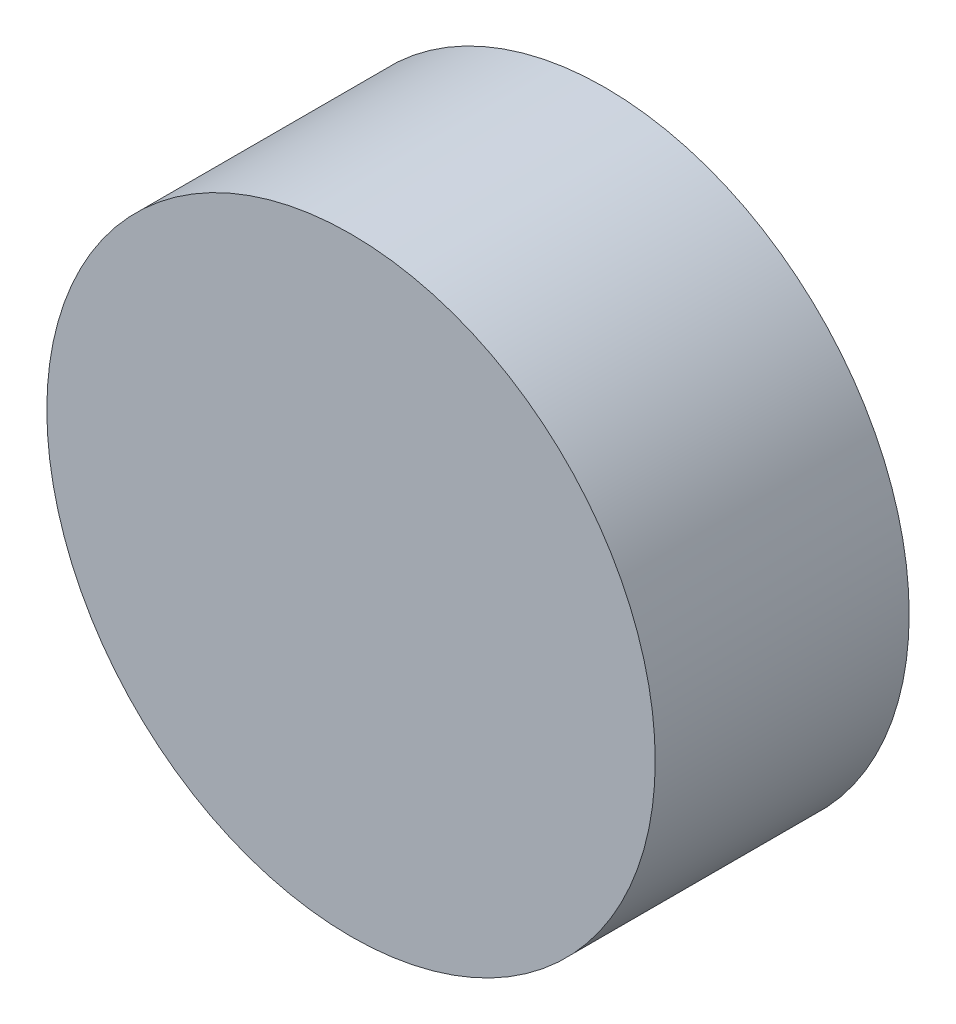
ISO-10303-21;
HEADER;
FILE_DESCRIPTION(('STEP AP214'),'2;1');
FILE_NAME('part.step','',(''),(''),'','','');
FILE_SCHEMA(('AUTOMOTIVE_DESIGN { 1 0 10303 214 1 1 1 1 }'));
ENDSEC;
DATA;
#1=APPLICATION_CONTEXT('core data for automotive mechanical design processes');
#2=APPLICATION_PROTOCOL_DEFINITION('international standard','automotive_design',2000,#1);
#3=PRODUCT_CONTEXT('',#1,'mechanical');
#4=PRODUCT('Part','Part','',(#3));
#5=PRODUCT_RELATED_PRODUCT_CATEGORY('part','',(#4));
#6=PRODUCT_DEFINITION_FORMATION('','',#4);
#7=PRODUCT_DEFINITION_CONTEXT('part definition',#1,'design');
#8=PRODUCT_DEFINITION('design','',#6,#7);
#9=PRODUCT_DEFINITION_SHAPE('','',#8);
#10=(LENGTH_UNIT() NAMED_UNIT(*) SI_UNIT(.MILLI.,.METRE.));
#11=(NAMED_UNIT(*) PLANE_ANGLE_UNIT() SI_UNIT($,.RADIAN.));
#12=(NAMED_UNIT(*) SI_UNIT($,.STERADIAN.) SOLID_ANGLE_UNIT());
#13=UNCERTAINTY_MEASURE_WITH_UNIT(LENGTH_MEASURE(1.E-05),#10,'distance_accuracy_value','');
#14=(GEOMETRIC_REPRESENTATION_CONTEXT(3) GLOBAL_UNCERTAINTY_ASSIGNED_CONTEXT((#13)) GLOBAL_UNIT_ASSIGNED_CONTEXT((#10,
#11,#12)) REPRESENTATION_CONTEXT('',''));
#15=CARTESIAN_POINT('',(0.,0.,0.));
#16=DIRECTION('',(0.,0.,1.));
#17=DIRECTION('',(1.,0.,0.));
#18=AXIS2_PLACEMENT_3D('',#15,#16,#17);
#19=CARTESIAN_POINT('',(0.,0.,0.));
#20=DIRECTION('',(0.,0.,1.));
#21=DIRECTION('',(1.,0.,0.));
#22=AXIS2_PLACEMENT_3D('',#19,#20,#21);
#23=PLANE('',#22);
#24=CARTESIAN_POINT('',(0.,0.,0.));
#25=DIRECTION('',(0.,0.,1.));
#26=DIRECTION('',(1.,0.,0.));
#27=AXIS2_PLACEMENT_3D('',#24,#25,#26);
#28=CIRCLE('',#27,18.25625);
#29=CARTESIAN_POINT('',(18.25625,0.,0.));
#30=VERTEX_POINT('',#29);
#31=EDGE_CURVE('E17',#30,#30,#28,.F.);
#32=ORIENTED_EDGE('',*,*,#31,.F.);
#33=EDGE_LOOP('',(#32));
#34=FACE_BOUND('',#33,.T.);
#35=ADVANCED_FACE('F14',(#34),#23,.T.);
#36=CARTESIAN_POINT('',(0.,0.,-15.24));
#37=DIRECTION('',(0.,0.,1.));
#38=DIRECTION('',(1.,0.,0.));
#39=AXIS2_PLACEMENT_3D('',#36,#37,#38);
#40=CYLINDRICAL_SURFACE('',#39,18.25625);
#41=ORIENTED_EDGE('',*,*,#31,.T.);
#42=EDGE_LOOP('',(#41));
#43=FACE_BOUND('',#42,.T.);
#44=CARTESIAN_POINT('',(0.,0.,-15.24));
#45=DIRECTION('',(0.,0.,1.));
#46=DIRECTION('',(1.,0.,0.));
#47=AXIS2_PLACEMENT_3D('',#44,#45,#46);
#48=CIRCLE('',#47,18.25625);
#49=CARTESIAN_POINT('',(18.25625,0.,-15.24));
#50=VERTEX_POINT('',#49);
#51=EDGE_CURVE('E10',#50,#50,#48,.T.);
#52=ORIENTED_EDGE('',*,*,#51,.T.);
#53=EDGE_LOOP('',(#52));
#54=FACE_BOUND('',#53,.T.);
#55=ADVANCED_FACE('F26',(#43,#54),#40,.T.);
#56=CARTESIAN_POINT('',(0.,0.,-15.24));
#57=DIRECTION('',(0.,0.,1.));
#58=DIRECTION('',(1.,0.,0.));
#59=AXIS2_PLACEMENT_3D('',#56,#57,#58);
#60=PLANE('',#59);
#61=ORIENTED_EDGE('',*,*,#51,.F.);
#62=EDGE_LOOP('',(#61));
#63=FACE_BOUND('',#62,.T.);
#64=ADVANCED_FACE('F33',(#63),#60,.F.);
#65=CLOSED_SHELL('',(#35,#55,#64));
#66=MANIFOLD_SOLID_BREP('B1',#65);
#67=ADVANCED_BREP_SHAPE_REPRESENTATION('',(#18,#66),#14);
#68=SHAPE_DEFINITION_REPRESENTATION(#9,#67);
ENDSEC;
END-ISO-10303-21;
